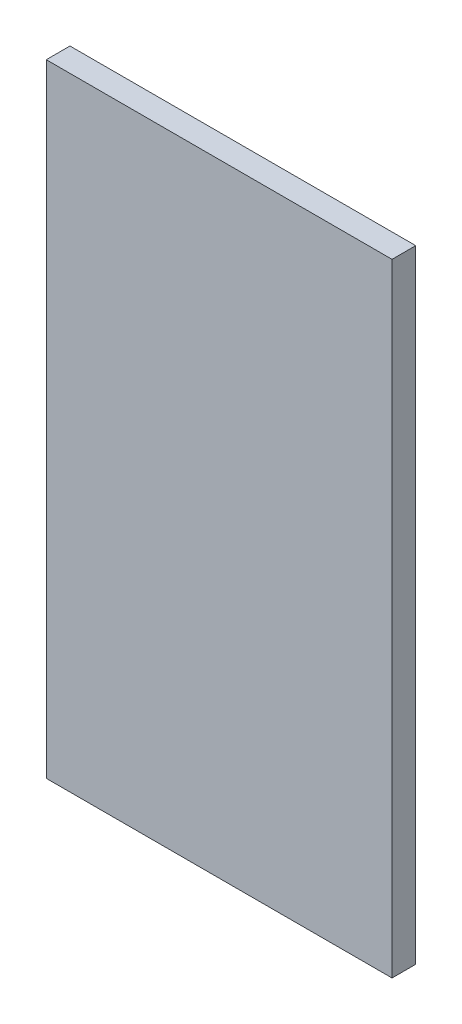
ISO-10303-21;
HEADER;
FILE_DESCRIPTION(('STEP AP214'),'2;1');
FILE_NAME('part.step','',(''),(''),'','','');
FILE_SCHEMA(('AUTOMOTIVE_DESIGN { 1 0 10303 214 1 1 1 1 }'));
ENDSEC;
DATA;
#1=APPLICATION_CONTEXT('core data for automotive mechanical design processes');
#2=APPLICATION_PROTOCOL_DEFINITION('international standard','automotive_design',2000,#1);
#3=PRODUCT_CONTEXT('',#1,'mechanical');
#4=PRODUCT('Part','Part','',(#3));
#5=PRODUCT_RELATED_PRODUCT_CATEGORY('part','',(#4));
#6=PRODUCT_DEFINITION_FORMATION('','',#4);
#7=PRODUCT_DEFINITION_CONTEXT('part definition',#1,'design');
#8=PRODUCT_DEFINITION('design','',#6,#7);
#9=PRODUCT_DEFINITION_SHAPE('','',#8);
#10=(LENGTH_UNIT() NAMED_UNIT(*) SI_UNIT(.MILLI.,.METRE.));
#11=(NAMED_UNIT(*) PLANE_ANGLE_UNIT() SI_UNIT($,.RADIAN.));
#12=(NAMED_UNIT(*) SI_UNIT($,.STERADIAN.) SOLID_ANGLE_UNIT());
#13=UNCERTAINTY_MEASURE_WITH_UNIT(LENGTH_MEASURE(1.E-05),#10,'distance_accuracy_value','');
#14=(GEOMETRIC_REPRESENTATION_CONTEXT(3) GLOBAL_UNCERTAINTY_ASSIGNED_CONTEXT((#13)) GLOBAL_UNIT_ASSIGNED_CONTEXT((#10,
#11,#12)) REPRESENTATION_CONTEXT('',''));
#15=CARTESIAN_POINT('',(0.,0.,0.));
#16=DIRECTION('',(0.,0.,1.));
#17=DIRECTION('',(1.,0.,0.));
#18=AXIS2_PLACEMENT_3D('',#15,#16,#17);
#19=CARTESIAN_POINT('',(11.40008,10.5,0.));
#20=DIRECTION('',(0.,0.,-1.));
#21=DIRECTION('',(-1.,0.,0.));
#22=AXIS2_PLACEMENT_3D('',#19,#20,#21);
#23=PLANE('',#22);
#24=DIRECTION('',(1.,0.,0.));
#25=VECTOR('',#24,1.);
#26=CARTESIAN_POINT('',(11.15008,10.95,0.));
#27=LINE('',#26,#25);
#28=CARTESIAN_POINT('',(11.15008,10.95,0.));
#29=VERTEX_POINT('',#28);
#30=CARTESIAN_POINT('',(11.65008,10.95,0.));
#31=VERTEX_POINT('',#30);
#32=EDGE_CURVE('E55',#29,#31,#27,.T.);
#33=ORIENTED_EDGE('',*,*,#32,.T.);
#34=DIRECTION('',(0.,1.,0.));
#35=VECTOR('',#34,1.);
#36=CARTESIAN_POINT('',(11.65008,10.95,0.));
#37=LINE('',#36,#35);
#38=CARTESIAN_POINT('',(11.65008,10.05,0.));
#39=VERTEX_POINT('',#38);
#40=EDGE_CURVE('E57',#31,#39,#37,.F.);
#41=ORIENTED_EDGE('',*,*,#40,.T.);
#42=DIRECTION('',(1.,0.,0.));
#43=VECTOR('',#42,1.);
#44=CARTESIAN_POINT('',(11.65008,10.05,0.));
#45=LINE('',#44,#43);
#46=CARTESIAN_POINT('',(11.15008,10.05,0.));
#47=VERTEX_POINT('',#46);
#48=EDGE_CURVE('E20',#39,#47,#45,.F.);
#49=ORIENTED_EDGE('',*,*,#48,.T.);
#50=DIRECTION('',(0.,1.,0.));
#51=VECTOR('',#50,1.);
#52=CARTESIAN_POINT('',(11.15008,10.05,0.));
#53=LINE('',#52,#51);
#54=EDGE_CURVE('E80',#47,#29,#53,.T.);
#55=ORIENTED_EDGE('',*,*,#54,.T.);
#56=EDGE_LOOP('',(#33,#41,#49,#55));
#57=FACE_BOUND('',#56,.T.);
#58=ADVANCED_FACE('F17',(#57),#23,.T.);
#59=CARTESIAN_POINT('',(11.65008,10.05,0.));
#60=DIRECTION('',(0.,1.,0.));
#61=DIRECTION('',(0.,0.,1.));
#62=AXIS2_PLACEMENT_3D('',#59,#60,#61);
#63=PLANE('',#62);
#64=DIRECTION('',(0.,0.,-1.));
#65=VECTOR('',#64,1.);
#66=CARTESIAN_POINT('',(11.15008,10.05,0.));
#67=LINE('',#66,#65);
#68=CARTESIAN_POINT('',(11.15008,10.05,0.03429));
#69=VERTEX_POINT('',#68);
#70=EDGE_CURVE('E68',#69,#47,#67,.T.);
#71=ORIENTED_EDGE('',*,*,#70,.T.);
#72=ORIENTED_EDGE('',*,*,#48,.F.);
#73=DIRECTION('',(0.,0.,1.));
#74=VECTOR('',#73,1.);
#75=CARTESIAN_POINT('',(11.65008,10.05,0.));
#76=LINE('',#75,#74);
#77=CARTESIAN_POINT('',(11.65008,10.05,0.03429));
#78=VERTEX_POINT('',#77);
#79=EDGE_CURVE('E63',#39,#78,#76,.T.);
#80=ORIENTED_EDGE('',*,*,#79,.T.);
#81=DIRECTION('',(1.,0.,0.));
#82=VECTOR('',#81,1.);
#83=CARTESIAN_POINT('',(11.40008,10.05,0.03429));
#84=LINE('',#83,#82);
#85=EDGE_CURVE('E83',#69,#78,#84,.T.);
#86=ORIENTED_EDGE('',*,*,#85,.F.);
#87=EDGE_LOOP('',(#71,#72,#80,#86));
#88=FACE_BOUND('',#87,.T.);
#89=ADVANCED_FACE('F65',(#88),#63,.F.);
#90=CARTESIAN_POINT('',(11.65008,10.95,0.));
#91=DIRECTION('',(-1.,0.,0.));
#92=DIRECTION('',(0.,0.,1.));
#93=AXIS2_PLACEMENT_3D('',#90,#91,#92);
#94=PLANE('',#93);
#95=ORIENTED_EDGE('',*,*,#79,.F.);
#96=ORIENTED_EDGE('',*,*,#40,.F.);
#97=DIRECTION('',(0.,0.,-1.));
#98=VECTOR('',#97,1.);
#99=CARTESIAN_POINT('',(11.65008,10.95,0.));
#100=LINE('',#99,#98);
#101=CARTESIAN_POINT('',(11.65008,10.95,0.03429));
#102=VERTEX_POINT('',#101);
#103=EDGE_CURVE('E75',#31,#102,#100,.F.);
#104=ORIENTED_EDGE('',*,*,#103,.T.);
#105=DIRECTION('',(0.,1.,0.));
#106=VECTOR('',#105,1.);
#107=CARTESIAN_POINT('',(11.65008,10.5,0.03429));
#108=LINE('',#107,#106);
#109=EDGE_CURVE('E72',#78,#102,#108,.T.);
#110=ORIENTED_EDGE('',*,*,#109,.F.);
#111=EDGE_LOOP('',(#95,#96,#104,#110));
#112=FACE_BOUND('',#111,.T.);
#113=ADVANCED_FACE('F70',(#112),#94,.F.);
#114=CARTESIAN_POINT('',(11.15008,10.95,0.));
#115=DIRECTION('',(0.,-1.,0.));
#116=DIRECTION('',(0.,0.,-1.));
#117=AXIS2_PLACEMENT_3D('',#114,#115,#116);
#118=PLANE('',#117);
#119=ORIENTED_EDGE('',*,*,#103,.F.);
#120=ORIENTED_EDGE('',*,*,#32,.F.);
#121=DIRECTION('',(0.,0.,-1.));
#122=VECTOR('',#121,1.);
#123=CARTESIAN_POINT('',(11.15008,10.95,0.));
#124=LINE('',#123,#122);
#125=CARTESIAN_POINT('',(11.15008,10.95,0.03429));
#126=VERTEX_POINT('',#125);
#127=EDGE_CURVE('E35',#29,#126,#124,.F.);
#128=ORIENTED_EDGE('',*,*,#127,.T.);
#129=DIRECTION('',(1.,0.,0.));
#130=VECTOR('',#129,1.);
#131=CARTESIAN_POINT('',(11.40008,10.95,0.03429));
#132=LINE('',#131,#130);
#133=EDGE_CURVE('E26',#102,#126,#132,.F.);
#134=ORIENTED_EDGE('',*,*,#133,.F.);
#135=EDGE_LOOP('',(#119,#120,#128,#134));
#136=FACE_BOUND('',#135,.T.);
#137=ADVANCED_FACE('F89',(#136),#118,.F.);
#138=CARTESIAN_POINT('',(11.15008,10.05,0.));
#139=DIRECTION('',(1.,0.,0.));
#140=DIRECTION('',(0.,0.,-1.));
#141=AXIS2_PLACEMENT_3D('',#138,#139,#140);
#142=PLANE('',#141);
#143=ORIENTED_EDGE('',*,*,#127,.F.);
#144=ORIENTED_EDGE('',*,*,#54,.F.);
#145=ORIENTED_EDGE('',*,*,#70,.F.);
#146=DIRECTION('',(0.,1.,0.));
#147=VECTOR('',#146,1.);
#148=CARTESIAN_POINT('',(11.15008,10.5,0.03429));
#149=LINE('',#148,#147);
#150=EDGE_CURVE('E11',#126,#69,#149,.F.);
#151=ORIENTED_EDGE('',*,*,#150,.F.);
#152=EDGE_LOOP('',(#143,#144,#145,#151));
#153=FACE_BOUND('',#152,.T.);
#154=ADVANCED_FACE('F91',(#153),#142,.F.);
#155=CARTESIAN_POINT('',(11.40008,10.5,0.03429));
#156=DIRECTION('',(0.,0.,1.));
#157=DIRECTION('',(1.,0.,0.));
#158=AXIS2_PLACEMENT_3D('',#155,#156,#157);
#159=PLANE('',#158);
#160=ORIENTED_EDGE('',*,*,#133,.T.);
#161=ORIENTED_EDGE('',*,*,#150,.T.);
#162=ORIENTED_EDGE('',*,*,#85,.T.);
#163=ORIENTED_EDGE('',*,*,#109,.T.);
#164=EDGE_LOOP('',(#160,#161,#162,#163));
#165=FACE_BOUND('',#164,.T.);
#166=ADVANCED_FACE('F88',(#165),#159,.T.);
#167=CLOSED_SHELL('',(#58,#89,#113,#137,#154,#166));
#168=MANIFOLD_SOLID_BREP('B1',#167);
#169=ADVANCED_BREP_SHAPE_REPRESENTATION('',(#18,#168),#14);
#170=SHAPE_DEFINITION_REPRESENTATION(#9,#169);
ENDSEC;
END-ISO-10303-21;
